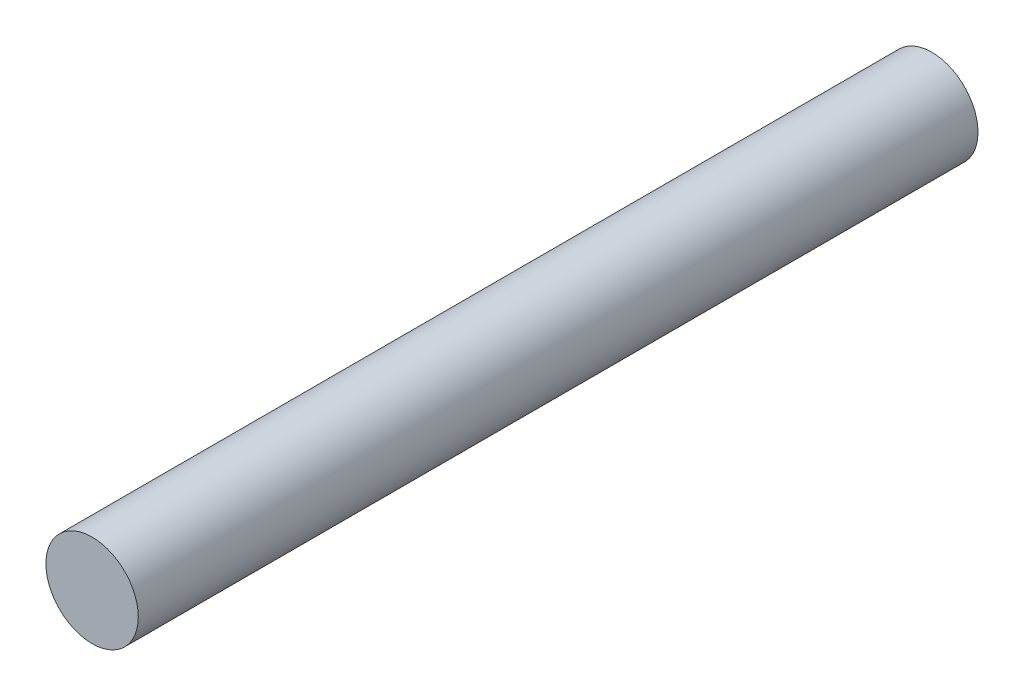
ISO-10303-21;
HEADER;
FILE_DESCRIPTION(('STEP AP214'),'2;1');
FILE_NAME('part.step','',(''),(''),'','','');
FILE_SCHEMA(('AUTOMOTIVE_DESIGN { 1 0 10303 214 1 1 1 1 }'));
ENDSEC;
DATA;
#1=APPLICATION_CONTEXT('core data for automotive mechanical design processes');
#2=APPLICATION_PROTOCOL_DEFINITION('international standard','automotive_design',2000,#1);
#3=PRODUCT_CONTEXT('',#1,'mechanical');
#4=PRODUCT('Part','Part','',(#3));
#5=PRODUCT_RELATED_PRODUCT_CATEGORY('part','',(#4));
#6=PRODUCT_DEFINITION_FORMATION('','',#4);
#7=PRODUCT_DEFINITION_CONTEXT('part definition',#1,'design');
#8=PRODUCT_DEFINITION('design','',#6,#7);
#9=PRODUCT_DEFINITION_SHAPE('','',#8);
#10=(LENGTH_UNIT() NAMED_UNIT(*) SI_UNIT(.MILLI.,.METRE.));
#11=(NAMED_UNIT(*) PLANE_ANGLE_UNIT() SI_UNIT($,.RADIAN.));
#12=(NAMED_UNIT(*) SI_UNIT($,.STERADIAN.) SOLID_ANGLE_UNIT());
#13=UNCERTAINTY_MEASURE_WITH_UNIT(LENGTH_MEASURE(1.E-05),#10,'distance_accuracy_value','');
#14=(GEOMETRIC_REPRESENTATION_CONTEXT(3) GLOBAL_UNCERTAINTY_ASSIGNED_CONTEXT((#13)) GLOBAL_UNIT_ASSIGNED_CONTEXT((#10,
#11,#12)) REPRESENTATION_CONTEXT('',''));
#15=CARTESIAN_POINT('',(0.,0.,0.));
#16=DIRECTION('',(0.,0.,1.));
#17=DIRECTION('',(1.,0.,0.));
#18=AXIS2_PLACEMENT_3D('',#15,#16,#17);
#19=CARTESIAN_POINT('',(0.,0.,30.));
#20=DIRECTION('',(0.,0.,-1.));
#21=DIRECTION('',(-1.,0.,0.));
#22=AXIS2_PLACEMENT_3D('',#19,#20,#21);
#23=CYLINDRICAL_SURFACE('',#22,1.65);
#24=CARTESIAN_POINT('',(0.,0.,30.));
#25=DIRECTION('',(0.,0.,1.));
#26=DIRECTION('',(1.,0.,0.));
#27=AXIS2_PLACEMENT_3D('',#24,#25,#26);
#28=CIRCLE('',#27,1.65);
#29=CARTESIAN_POINT('',(1.65,0.,30.));
#30=VERTEX_POINT('',#29);
#31=EDGE_CURVE('E10',#30,#30,#28,.T.);
#32=ORIENTED_EDGE('',*,*,#31,.F.);
#33=EDGE_LOOP('',(#32));
#34=FACE_BOUND('',#33,.T.);
#35=CARTESIAN_POINT('',(0.,0.,0.));
#36=DIRECTION('',(0.,0.,1.));
#37=DIRECTION('',(1.,0.,0.));
#38=AXIS2_PLACEMENT_3D('',#35,#36,#37);
#39=CIRCLE('',#38,1.65);
#40=CARTESIAN_POINT('',(1.65,0.,0.));
#41=VERTEX_POINT('',#40);
#42=EDGE_CURVE('E33',#41,#41,#39,.T.);
#43=ORIENTED_EDGE('',*,*,#42,.T.);
#44=EDGE_LOOP('',(#43));
#45=FACE_BOUND('',#44,.T.);
#46=ADVANCED_FACE('F30',(#34,#45),#23,.T.);
#47=CARTESIAN_POINT('',(0.,0.,30.));
#48=DIRECTION('',(0.,0.,1.));
#49=DIRECTION('',(1.,0.,0.));
#50=AXIS2_PLACEMENT_3D('',#47,#48,#49);
#51=PLANE('',#50);
#52=ORIENTED_EDGE('',*,*,#31,.T.);
#53=EDGE_LOOP('',(#52));
#54=FACE_BOUND('',#53,.T.);
#55=ADVANCED_FACE('F45',(#54),#51,.T.);
#56=CARTESIAN_POINT('',(0.,0.,0.));
#57=DIRECTION('',(0.,0.,1.));
#58=DIRECTION('',(1.,0.,0.));
#59=AXIS2_PLACEMENT_3D('',#56,#57,#58);
#60=PLANE('',#59);
#61=ORIENTED_EDGE('',*,*,#42,.F.);
#62=EDGE_LOOP('',(#61));
#63=FACE_BOUND('',#62,.T.);
#64=ADVANCED_FACE('F43',(#63),#60,.F.);
#65=CLOSED_SHELL('',(#46,#55,#64));
#66=MANIFOLD_SOLID_BREP('B2',#65);
#67=ADVANCED_BREP_SHAPE_REPRESENTATION('',(#18,#66),#14);
#68=SHAPE_DEFINITION_REPRESENTATION(#9,#67);
ENDSEC;
END-ISO-10303-21;
